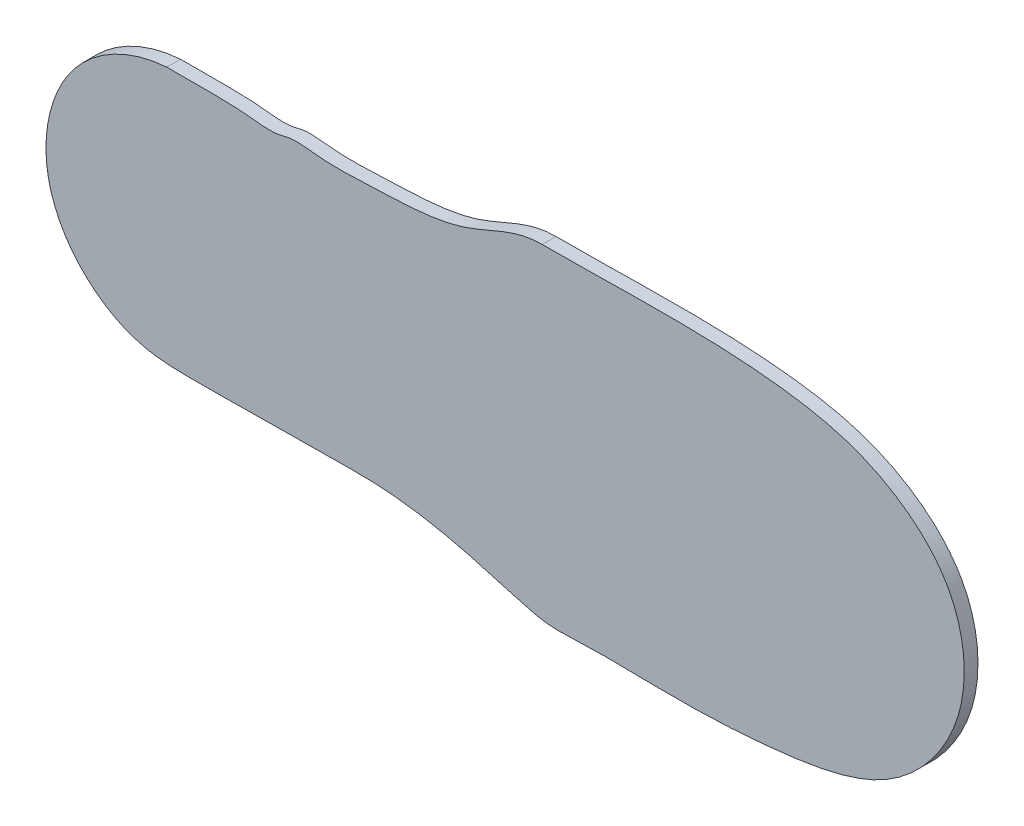
ISO-10303-21;
HEADER;
FILE_DESCRIPTION(('STEP AP214'),'2;1');
FILE_NAME('part.step','',(''),(''),'','','');
FILE_SCHEMA(('AUTOMOTIVE_DESIGN { 1 0 10303 214 1 1 1 1 }'));
ENDSEC;
DATA;
#1=APPLICATION_CONTEXT('core data for automotive mechanical design processes');
#2=APPLICATION_PROTOCOL_DEFINITION('international standard','automotive_design',2000,#1);
#3=PRODUCT_CONTEXT('',#1,'mechanical');
#4=PRODUCT('Part','Part','',(#3));
#5=PRODUCT_RELATED_PRODUCT_CATEGORY('part','',(#4));
#6=PRODUCT_DEFINITION_FORMATION('','',#4);
#7=PRODUCT_DEFINITION_CONTEXT('part definition',#1,'design');
#8=PRODUCT_DEFINITION('design','',#6,#7);
#9=PRODUCT_DEFINITION_SHAPE('','',#8);
#10=(LENGTH_UNIT() NAMED_UNIT(*) SI_UNIT(.MILLI.,.METRE.));
#11=(NAMED_UNIT(*) PLANE_ANGLE_UNIT() SI_UNIT($,.RADIAN.));
#12=(NAMED_UNIT(*) SI_UNIT($,.STERADIAN.) SOLID_ANGLE_UNIT());
#13=UNCERTAINTY_MEASURE_WITH_UNIT(LENGTH_MEASURE(1.E-05),#10,'distance_accuracy_value','');
#14=(GEOMETRIC_REPRESENTATION_CONTEXT(3) GLOBAL_UNCERTAINTY_ASSIGNED_CONTEXT((#13)) GLOBAL_UNIT_ASSIGNED_CONTEXT((#10,
#11,#12)) REPRESENTATION_CONTEXT('',''));
#15=CARTESIAN_POINT('',(0.,0.,0.));
#16=DIRECTION('',(0.,0.,1.));
#17=DIRECTION('',(1.,0.,0.));
#18=AXIS2_PLACEMENT_3D('',#15,#16,#17);
#19=CARTESIAN_POINT('',(5.53784323267048,36.0623091835957,4.3037651134611));
#20=CARTESIAN_POINT('',(-0.667896515106985,36.1062754353635,4.3037651134611));
#21=CARTESIAN_POINT('',(-11.8908272736825,28.7362865936999,4.3037651134611));
#22=CARTESIAN_POINT('',(-29.408005052225,28.453798189547,4.3037651134611));
#23=CARTESIAN_POINT('',(-42.3686762348303,27.6974632018116,4.3037651134611));
#24=CARTESIAN_POINT('',(-49.4037977130239,28.9214378329443,4.3037651134611));
#25=CARTESIAN_POINT('',(-54.0888049042547,27.4696936012756,4.3037651134611));
#26=CARTESIAN_POINT('',(-63.196499820373,28.9272768294994,4.3037651134611));
#27=CARTESIAN_POINT('',(-71.3883237083493,28.3175322316099,4.3037651134611));
#28=CARTESIAN_POINT('',(-77.6156571286976,28.4824072294366,4.3037651134611));
#29=B_SPLINE_CURVE_WITH_KNOTS('',3,(#19,#20,#21,#22,#23,#24,#25,#26,#27,#28),.UNSPECIFIED.,.F.,
.F.,(4,1,1,1,1,1,1,4),(0.,0.214022448469197,0.457131402921372,0.607226327755179,
0.680167848756412,0.70419459453478,0.779691256464848,1.),.UNSPECIFIED.);
#30=DIRECTION('',(0.,0.,-1.));
#31=VECTOR('',#30,1.);
#32=SURFACE_OF_LINEAR_EXTRUSION('',#29,#31);
#33=DIRECTION('',(0.,0.,-1.));
#34=VECTOR('',#33,1.);
#35=CARTESIAN_POINT('',(5.53784323267048,36.0623091835957,4.3037651134611));
#36=LINE('',#35,#34);
#37=CARTESIAN_POINT('',(5.53784323267048,36.0623091835957,4.3037651134611));
#38=VERTEX_POINT('',#37);
#39=CARTESIAN_POINT('',(5.53784323267048,36.0623091835957,1.2557651134611));
#40=VERTEX_POINT('',#39);
#41=EDGE_CURVE('E48',#38,#40,#36,.T.);
#42=ORIENTED_EDGE('',*,*,#41,.T.);
#43=CARTESIAN_POINT('',(5.53784323267048,36.0623091835957,1.2557651134611));
#44=CARTESIAN_POINT('',(-0.667896515106985,36.1062754353635,1.2557651134611));
#45=CARTESIAN_POINT('',(-11.8908272736825,28.7362865936999,1.2557651134611));
#46=CARTESIAN_POINT('',(-29.408005052225,28.453798189547,1.2557651134611));
#47=CARTESIAN_POINT('',(-42.3686762348303,27.6974632018116,1.2557651134611));
#48=CARTESIAN_POINT('',(-49.4037977130239,28.9214378329443,1.2557651134611));
#49=CARTESIAN_POINT('',(-54.0888049042547,27.4696936012756,1.2557651134611));
#50=CARTESIAN_POINT('',(-63.196499820373,28.9272768294994,1.2557651134611));
#51=CARTESIAN_POINT('',(-71.3883237083493,28.3175322316099,1.2557651134611));
#52=CARTESIAN_POINT('',(-77.6156571286976,28.4824072294366,1.2557651134611));
#53=B_SPLINE_CURVE_WITH_KNOTS('',3,(#43,#44,#45,#46,#47,#48,#49,#50,#51,#52),.UNSPECIFIED.,.F.,
.F.,(4,1,1,1,1,1,1,4),(0.,0.214022448469197,0.457131402921372,0.607226327755179,
0.680167848756412,0.70419459453478,0.779691256464848,1.),.UNSPECIFIED.);
#54=CARTESIAN_POINT('',(-77.6156571286976,28.4824072294366,1.2557651134611));
#55=VERTEX_POINT('',#54);
#56=EDGE_CURVE('E54',#55,#40,#53,.F.);
#57=ORIENTED_EDGE('',*,*,#56,.F.);
#58=DIRECTION('',(0.,0.,-1.));
#59=VECTOR('',#58,1.);
#60=CARTESIAN_POINT('',(-77.6156571286976,28.4824072294366,4.3037651134611));
#61=LINE('',#60,#59);
#62=CARTESIAN_POINT('',(-77.6156571286976,28.4824072294366,4.3037651134611));
#63=VERTEX_POINT('',#62);
#64=EDGE_CURVE('E11',#63,#55,#61,.T.);
#65=ORIENTED_EDGE('',*,*,#64,.F.);
#66=EDGE_CURVE('E70',#38,#63,#29,.T.);
#67=ORIENTED_EDGE('',*,*,#66,.F.);
#68=EDGE_LOOP('',(#42,#57,#65,#67));
#69=FACE_BOUND('',#68,.T.);
#70=ADVANCED_FACE('F40',(#69),#32,.F.);
#71=CARTESIAN_POINT('',(-77.6156571286976,28.4824072294366,4.3037651134611));
#72=CARTESIAN_POINT('',(-85.5875649744661,27.9605625804674,4.3037651134611));
#73=CARTESIAN_POINT('',(-101.549940595322,19.8916099361518,4.3037651134611));
#74=CARTESIAN_POINT('',(-106.826557007277,-4.26903095621853,4.3037651134611));
#75=CARTESIAN_POINT('',(-97.1679817238527,-20.9061510966949,4.3037651134611));
#76=CARTESIAN_POINT('',(-84.8682112668781,-28.1488642451636,4.3037651134611));
#77=CARTESIAN_POINT('',(-70.3864345083841,-28.7239773765588,4.3037651134611));
#78=CARTESIAN_POINT('',(-57.5975143338619,-28.2641036045678,4.3037651134611));
#79=CARTESIAN_POINT('',(-43.5510615936016,-28.3784845754383,4.3037651134611));
#80=CARTESIAN_POINT('',(-30.055656856739,-27.8845019849263,4.3037651134611));
#81=CARTESIAN_POINT('',(-15.7498158512866,-30.0615686939403,4.3037651134611));
#82=CARTESIAN_POINT('',(-4.73785089659706,-33.2561349015479,4.3037651134611));
#83=CARTESIAN_POINT('',(1.96626798165653,-35.1793567231026,4.3037651134611));
#84=CARTESIAN_POINT('',(7.36604796278948,-36.4953784715535,4.3037651134611));
#85=CARTESIAN_POINT('',(17.7410415654543,-35.7317092993419,4.3037651134611));
#86=CARTESIAN_POINT('',(35.8973434006722,-36.4888717012406,4.3037651134611));
#87=CARTESIAN_POINT('',(58.6480674924366,-35.4369917361391,4.3037651134611));
#88=CARTESIAN_POINT('',(84.7222790305748,-30.4322315610656,4.3037651134611));
#89=CARTESIAN_POINT('',(100.83077130376,-9.06697317700586,4.3037651134611));
#90=CARTESIAN_POINT('',(97.9808595531241,17.4658282460258,4.3037651134611));
#91=CARTESIAN_POINT('',(78.7665721378371,31.671180803138,4.3037651134611));
#92=CARTESIAN_POINT('',(47.010973080433,37.5561765315106,4.3037651134611));
#93=CARTESIAN_POINT('',(22.9303150324568,36.007863310585,4.3037651134611));
#94=CARTESIAN_POINT('',(5.53784323267048,36.0623091835957,4.3037651134611));
#95=B_SPLINE_CURVE_WITH_KNOTS('',3,(#71,#72,#73,#74,#75,#76,#77,#78,#79,#80,#81,#82,#83,#84,#85,
#86,#87,#88,#89,#90,#91,#92,#93,#94),.UNSPECIFIED.,.F.,.F.,(4,1,1,1,1,1,1,1,1,1,1,1,1,1,1,1,1,1,
1,1,1,4),(0.,0.0614895592213728,0.124158776893184,0.164378570483998,0.202472134506398,
0.227838511837445,0.274367311310463,0.301011416088794,0.335563353593711,0.377828251591594,
0.411274949707023,0.423498766427471,0.431400319281546,0.45374608281543,0.502360475194352,
0.571016906675975,0.629323360908699,0.699732037006104,0.752671405076551,0.81734203230962,
0.865822424760326,1.),.UNSPECIFIED.);
#96=DIRECTION('',(0.,0.,-1.));
#97=VECTOR('',#96,1.);
#98=SURFACE_OF_LINEAR_EXTRUSION('',#95,#97);
#99=ORIENTED_EDGE('',*,*,#64,.T.);
#100=CARTESIAN_POINT('',(-77.6156571286976,28.4824072294366,1.2557651134611));
#101=CARTESIAN_POINT('',(-85.5875649744661,27.9605625804674,1.2557651134611));
#102=CARTESIAN_POINT('',(-101.549940595322,19.8916099361518,1.2557651134611));
#103=CARTESIAN_POINT('',(-106.826557007277,-4.26903095621853,1.2557651134611));
#104=CARTESIAN_POINT('',(-97.1679817238527,-20.9061510966949,1.2557651134611));
#105=CARTESIAN_POINT('',(-84.8682112668781,-28.1488642451636,1.2557651134611));
#106=CARTESIAN_POINT('',(-70.3864345083841,-28.7239773765588,1.2557651134611));
#107=CARTESIAN_POINT('',(-57.5975143338619,-28.2641036045678,1.2557651134611));
#108=CARTESIAN_POINT('',(-43.5510615936016,-28.3784845754383,1.2557651134611));
#109=CARTESIAN_POINT('',(-30.055656856739,-27.8845019849263,1.2557651134611));
#110=CARTESIAN_POINT('',(-15.7498158512866,-30.0615686939403,1.2557651134611));
#111=CARTESIAN_POINT('',(-4.73785089659706,-33.2561349015479,1.2557651134611));
#112=CARTESIAN_POINT('',(1.96626798165653,-35.1793567231026,1.2557651134611));
#113=CARTESIAN_POINT('',(7.36604796278948,-36.4953784715535,1.2557651134611));
#114=CARTESIAN_POINT('',(17.7410415654543,-35.7317092993419,1.2557651134611));
#115=CARTESIAN_POINT('',(35.8973434006722,-36.4888717012406,1.2557651134611));
#116=CARTESIAN_POINT('',(58.6480674924366,-35.4369917361391,1.2557651134611));
#117=CARTESIAN_POINT('',(84.7222790305748,-30.4322315610656,1.2557651134611));
#118=CARTESIAN_POINT('',(100.83077130376,-9.06697317700586,1.2557651134611));
#119=CARTESIAN_POINT('',(97.9808595531241,17.4658282460258,1.2557651134611));
#120=CARTESIAN_POINT('',(78.7665721378371,31.671180803138,1.2557651134611));
#121=CARTESIAN_POINT('',(47.010973080433,37.5561765315106,1.2557651134611));
#122=CARTESIAN_POINT('',(22.9303150324568,36.007863310585,1.2557651134611));
#123=CARTESIAN_POINT('',(5.53784323267048,36.0623091835957,1.2557651134611));
#124=B_SPLINE_CURVE_WITH_KNOTS('',3,(#100,#101,#102,#103,#104,#105,#106,#107,#108,#109,#110,
#111,#112,#113,#114,#115,#116,#117,#118,#119,#120,#121,#122,#123),.UNSPECIFIED.,.F.,.F.,(4,1,1,
1,1,1,1,1,1,1,1,1,1,1,1,1,1,1,1,1,1,4),(0.,0.0614895592213728,0.124158776893184,
0.164378570483998,0.202472134506398,0.227838511837445,0.274367311310463,0.301011416088794,
0.335563353593711,0.377828251591594,0.411274949707023,0.423498766427471,0.431400319281546,
0.45374608281543,0.502360475194352,0.571016906675975,0.629323360908699,0.699732037006104,
0.752671405076551,0.81734203230962,0.865822424760326,1.),.UNSPECIFIED.);
#125=EDGE_CURVE('E66',#40,#55,#124,.F.);
#126=ORIENTED_EDGE('',*,*,#125,.F.);
#127=ORIENTED_EDGE('',*,*,#41,.F.);
#128=EDGE_CURVE('E61',#63,#38,#95,.T.);
#129=ORIENTED_EDGE('',*,*,#128,.F.);
#130=EDGE_LOOP('',(#99,#126,#127,#129));
#131=FACE_BOUND('',#130,.T.);
#132=ADVANCED_FACE('F76',(#131),#98,.F.);
#133=CARTESIAN_POINT('',(-35.5496780248701,28.0855146661618,4.3037651134611));
#134=DIRECTION('',(0.,0.,-1.));
#135=DIRECTION('',(-1.,0.,0.));
#136=AXIS2_PLACEMENT_3D('',#133,#134,#135);
#137=PLANE('',#136);
#138=ORIENTED_EDGE('',*,*,#66,.T.);
#139=ORIENTED_EDGE('',*,*,#128,.T.);
#140=EDGE_LOOP('',(#138,#139));
#141=FACE_BOUND('',#140,.T.);
#142=ADVANCED_FACE('F78',(#141),#137,.F.);
#143=CARTESIAN_POINT('',(0.,0.,1.2557651134611));
#144=DIRECTION('',(0.,0.,1.));
#145=DIRECTION('',(1.,0.,0.));
#146=AXIS2_PLACEMENT_3D('',#143,#144,#145);
#147=PLANE('',#146);
#148=ORIENTED_EDGE('',*,*,#125,.T.);
#149=ORIENTED_EDGE('',*,*,#56,.T.);
#150=EDGE_LOOP('',(#148,#149));
#151=FACE_BOUND('',#150,.T.);
#152=ADVANCED_FACE('F67',(#151),#147,.F.);
#153=CLOSED_SHELL('',(#70,#132,#142,#152));
#154=MANIFOLD_SOLID_BREP('B2',#153);
#155=ADVANCED_BREP_SHAPE_REPRESENTATION('',(#18,#154),#14);
#156=SHAPE_DEFINITION_REPRESENTATION(#9,#155);
ENDSEC;
END-ISO-10303-21;
